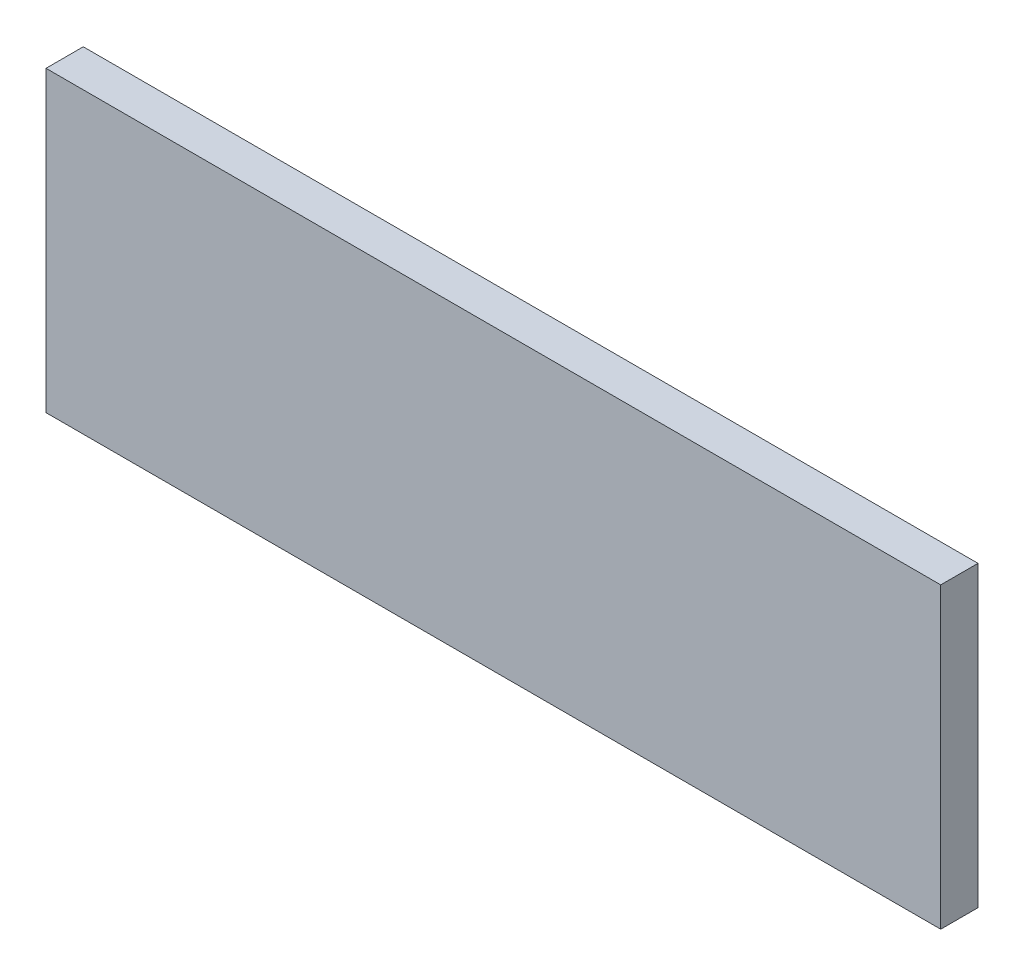
ISO-10303-21;
HEADER;
FILE_DESCRIPTION(('STEP AP214'),'2;1');
FILE_NAME('part.step','',(''),(''),'','','');
FILE_SCHEMA(('AUTOMOTIVE_DESIGN { 1 0 10303 214 1 1 1 1 }'));
ENDSEC;
DATA;
#1=APPLICATION_CONTEXT('core data for automotive mechanical design processes');
#2=APPLICATION_PROTOCOL_DEFINITION('international standard','automotive_design',2000,#1);
#3=PRODUCT_CONTEXT('',#1,'mechanical');
#4=PRODUCT('Part','Part','',(#3));
#5=PRODUCT_RELATED_PRODUCT_CATEGORY('part','',(#4));
#6=PRODUCT_DEFINITION_FORMATION('','',#4);
#7=PRODUCT_DEFINITION_CONTEXT('part definition',#1,'design');
#8=PRODUCT_DEFINITION('design','',#6,#7);
#9=PRODUCT_DEFINITION_SHAPE('','',#8);
#10=(LENGTH_UNIT() NAMED_UNIT(*) SI_UNIT(.MILLI.,.METRE.));
#11=(NAMED_UNIT(*) PLANE_ANGLE_UNIT() SI_UNIT($,.RADIAN.));
#12=(NAMED_UNIT(*) SI_UNIT($,.STERADIAN.) SOLID_ANGLE_UNIT());
#13=UNCERTAINTY_MEASURE_WITH_UNIT(LENGTH_MEASURE(1.E-05),#10,'distance_accuracy_value','');
#14=(GEOMETRIC_REPRESENTATION_CONTEXT(3) GLOBAL_UNCERTAINTY_ASSIGNED_CONTEXT((#13)) GLOBAL_UNIT_ASSIGNED_CONTEXT((#10,
#11,#12)) REPRESENTATION_CONTEXT('',''));
#15=CARTESIAN_POINT('',(0.,0.,0.));
#16=DIRECTION('',(0.,0.,1.));
#17=DIRECTION('',(1.,0.,0.));
#18=AXIS2_PLACEMENT_3D('',#15,#16,#17);
#19=CARTESIAN_POINT('',(0.,0.,-8.81));
#20=DIRECTION('',(0.,0.,1.));
#21=DIRECTION('',(1.,0.,0.));
#22=AXIS2_PLACEMENT_3D('',#19,#20,#21);
#23=PLANE('',#22);
#24=DIRECTION('',(1.,0.,0.));
#25=VECTOR('',#24,1.);
#26=CARTESIAN_POINT('',(8.68,-1.605,-8.81));
#27=LINE('',#26,#25);
#28=CARTESIAN_POINT('',(-3.32,-1.605,-8.81));
#29=VERTEX_POINT('',#28);
#30=CARTESIAN_POINT('',(8.68,-1.605,-8.81));
#31=VERTEX_POINT('',#30);
#32=EDGE_CURVE('E68',#29,#31,#27,.T.);
#33=ORIENTED_EDGE('',*,*,#32,.F.);
#34=DIRECTION('',(0.,1.,0.));
#35=VECTOR('',#34,1.);
#36=CARTESIAN_POINT('',(-3.32,-1.605,-8.81));
#37=LINE('',#36,#35);
#38=CARTESIAN_POINT('',(-3.32,-5.605,-8.81));
#39=VERTEX_POINT('',#38);
#40=EDGE_CURVE('E20',#39,#29,#37,.T.);
#41=ORIENTED_EDGE('',*,*,#40,.F.);
#42=DIRECTION('',(1.,0.,0.));
#43=VECTOR('',#42,1.);
#44=CARTESIAN_POINT('',(-3.32,-5.605,-8.81));
#45=LINE('',#44,#43);
#46=CARTESIAN_POINT('',(8.68,-5.605,-8.81));
#47=VERTEX_POINT('',#46);
#48=EDGE_CURVE('E58',#47,#39,#45,.F.);
#49=ORIENTED_EDGE('',*,*,#48,.F.);
#50=DIRECTION('',(0.,1.,0.));
#51=VECTOR('',#50,1.);
#52=CARTESIAN_POINT('',(8.68,-5.605,-8.81));
#53=LINE('',#52,#51);
#54=EDGE_CURVE('E53',#31,#47,#53,.F.);
#55=ORIENTED_EDGE('',*,*,#54,.F.);
#56=EDGE_LOOP('',(#33,#41,#49,#55));
#57=FACE_BOUND('',#56,.T.);
#58=ADVANCED_FACE('F17',(#57),#23,.T.);
#59=CARTESIAN_POINT('',(-3.32,-1.605,-9.31));
#60=DIRECTION('',(-1.,0.,0.));
#61=DIRECTION('',(0.,0.,1.));
#62=AXIS2_PLACEMENT_3D('',#59,#60,#61);
#63=PLANE('',#62);
#64=DIRECTION('',(0.,0.,1.));
#65=VECTOR('',#64,1.);
#66=CARTESIAN_POINT('',(-3.32,-1.605,-9.31));
#67=LINE('',#66,#65);
#68=CARTESIAN_POINT('',(-3.32,-1.605,-9.31));
#69=VERTEX_POINT('',#68);
#70=EDGE_CURVE('E79',#69,#29,#67,.T.);
#71=ORIENTED_EDGE('',*,*,#70,.F.);
#72=DIRECTION('',(0.,1.,0.));
#73=VECTOR('',#72,1.);
#74=CARTESIAN_POINT('',(-3.32,0.,-9.31));
#75=LINE('',#74,#73);
#76=CARTESIAN_POINT('',(-3.32,-5.605,-9.31));
#77=VERTEX_POINT('',#76);
#78=EDGE_CURVE('E74',#69,#77,#75,.F.);
#79=ORIENTED_EDGE('',*,*,#78,.T.);
#80=DIRECTION('',(0.,0.,-1.));
#81=VECTOR('',#80,1.);
#82=CARTESIAN_POINT('',(-3.32,-5.605,-9.31));
#83=LINE('',#82,#81);
#84=EDGE_CURVE('E63',#39,#77,#83,.T.);
#85=ORIENTED_EDGE('',*,*,#84,.F.);
#86=ORIENTED_EDGE('',*,*,#40,.T.);
#87=EDGE_LOOP('',(#71,#79,#85,#86));
#88=FACE_BOUND('',#87,.T.);
#89=ADVANCED_FACE('F73',(#88),#63,.T.);
#90=CARTESIAN_POINT('',(-3.32,-5.605,-9.31));
#91=DIRECTION('',(0.,-1.,0.));
#92=DIRECTION('',(0.,0.,-1.));
#93=AXIS2_PLACEMENT_3D('',#90,#91,#92);
#94=PLANE('',#93);
#95=ORIENTED_EDGE('',*,*,#84,.T.);
#96=DIRECTION('',(1.,0.,0.));
#97=VECTOR('',#96,1.);
#98=CARTESIAN_POINT('',(0.,-5.605,-9.31));
#99=LINE('',#98,#97);
#100=CARTESIAN_POINT('',(8.68,-5.605,-9.31));
#101=VERTEX_POINT('',#100);
#102=EDGE_CURVE('E84',#77,#101,#99,.T.);
#103=ORIENTED_EDGE('',*,*,#102,.T.);
#104=DIRECTION('',(0.,0.,-1.));
#105=VECTOR('',#104,1.);
#106=CARTESIAN_POINT('',(8.68,-5.605,-9.31));
#107=LINE('',#106,#105);
#108=EDGE_CURVE('E65',#47,#101,#107,.T.);
#109=ORIENTED_EDGE('',*,*,#108,.F.);
#110=ORIENTED_EDGE('',*,*,#48,.T.);
#111=EDGE_LOOP('',(#95,#103,#109,#110));
#112=FACE_BOUND('',#111,.T.);
#113=ADVANCED_FACE('F60',(#112),#94,.T.);
#114=CARTESIAN_POINT('',(8.68,-5.605,-9.31));
#115=DIRECTION('',(1.,0.,0.));
#116=DIRECTION('',(0.,0.,-1.));
#117=AXIS2_PLACEMENT_3D('',#114,#115,#116);
#118=PLANE('',#117);
#119=ORIENTED_EDGE('',*,*,#108,.T.);
#120=DIRECTION('',(0.,1.,0.));
#121=VECTOR('',#120,1.);
#122=CARTESIAN_POINT('',(8.68,0.,-9.31));
#123=LINE('',#122,#121);
#124=CARTESIAN_POINT('',(8.68,-1.605,-9.31));
#125=VERTEX_POINT('',#124);
#126=EDGE_CURVE('E26',#101,#125,#123,.T.);
#127=ORIENTED_EDGE('',*,*,#126,.T.);
#128=DIRECTION('',(0.,0.,1.));
#129=VECTOR('',#128,1.);
#130=CARTESIAN_POINT('',(8.68,-1.605,-9.31));
#131=LINE('',#130,#129);
#132=EDGE_CURVE('E34',#31,#125,#131,.F.);
#133=ORIENTED_EDGE('',*,*,#132,.F.);
#134=ORIENTED_EDGE('',*,*,#54,.T.);
#135=EDGE_LOOP('',(#119,#127,#133,#134));
#136=FACE_BOUND('',#135,.T.);
#137=ADVANCED_FACE('F88',(#136),#118,.T.);
#138=CARTESIAN_POINT('',(8.68,-1.605,-9.31));
#139=DIRECTION('',(0.,1.,0.));
#140=DIRECTION('',(0.,0.,1.));
#141=AXIS2_PLACEMENT_3D('',#138,#139,#140);
#142=PLANE('',#141);
#143=ORIENTED_EDGE('',*,*,#132,.T.);
#144=DIRECTION('',(1.,0.,0.));
#145=VECTOR('',#144,1.);
#146=CARTESIAN_POINT('',(0.,-1.605,-9.31));
#147=LINE('',#146,#145);
#148=EDGE_CURVE('E11',#125,#69,#147,.F.);
#149=ORIENTED_EDGE('',*,*,#148,.T.);
#150=ORIENTED_EDGE('',*,*,#70,.T.);
#151=ORIENTED_EDGE('',*,*,#32,.T.);
#152=EDGE_LOOP('',(#143,#149,#150,#151));
#153=FACE_BOUND('',#152,.T.);
#154=ADVANCED_FACE('F91',(#153),#142,.T.);
#155=CARTESIAN_POINT('',(0.,0.,-9.31));
#156=DIRECTION('',(0.,0.,1.));
#157=DIRECTION('',(1.,0.,0.));
#158=AXIS2_PLACEMENT_3D('',#155,#156,#157);
#159=PLANE('',#158);
#160=ORIENTED_EDGE('',*,*,#126,.F.);
#161=ORIENTED_EDGE('',*,*,#102,.F.);
#162=ORIENTED_EDGE('',*,*,#78,.F.);
#163=ORIENTED_EDGE('',*,*,#148,.F.);
#164=EDGE_LOOP('',(#160,#161,#162,#163));
#165=FACE_BOUND('',#164,.T.);
#166=ADVANCED_FACE('F90',(#165),#159,.F.);
#167=CLOSED_SHELL('',(#58,#89,#113,#137,#154,#166));
#168=MANIFOLD_SOLID_BREP('B1',#167);
#169=ADVANCED_BREP_SHAPE_REPRESENTATION('',(#18,#168),#14);
#170=SHAPE_DEFINITION_REPRESENTATION(#9,#169);
ENDSEC;
END-ISO-10303-21;
